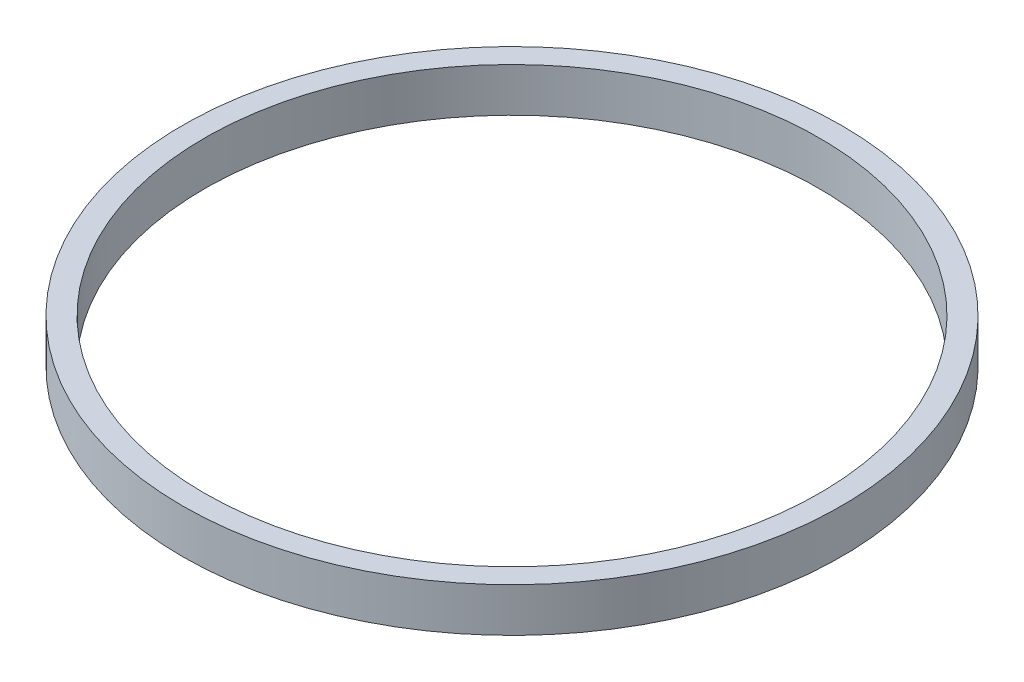
ISO-10303-21;
HEADER;
FILE_DESCRIPTION(('STEP AP214'),'2;1');
FILE_NAME('part.step','',(''),(''),'','','');
FILE_SCHEMA(('AUTOMOTIVE_DESIGN { 1 0 10303 214 1 1 1 1 }'));
ENDSEC;
DATA;
#1=APPLICATION_CONTEXT('core data for automotive mechanical design processes');
#2=APPLICATION_PROTOCOL_DEFINITION('international standard','automotive_design',2000,#1);
#3=PRODUCT_CONTEXT('',#1,'mechanical');
#4=PRODUCT('Part','Part','',(#3));
#5=PRODUCT_RELATED_PRODUCT_CATEGORY('part','',(#4));
#6=PRODUCT_DEFINITION_FORMATION('','',#4);
#7=PRODUCT_DEFINITION_CONTEXT('part definition',#1,'design');
#8=PRODUCT_DEFINITION('design','',#6,#7);
#9=PRODUCT_DEFINITION_SHAPE('','',#8);
#10=(LENGTH_UNIT() NAMED_UNIT(*) SI_UNIT(.MILLI.,.METRE.));
#11=(NAMED_UNIT(*) PLANE_ANGLE_UNIT() SI_UNIT($,.RADIAN.));
#12=(NAMED_UNIT(*) SI_UNIT($,.STERADIAN.) SOLID_ANGLE_UNIT());
#13=UNCERTAINTY_MEASURE_WITH_UNIT(LENGTH_MEASURE(1.E-05),#10,'distance_accuracy_value','');
#14=(GEOMETRIC_REPRESENTATION_CONTEXT(3) GLOBAL_UNCERTAINTY_ASSIGNED_CONTEXT((#13)) GLOBAL_UNIT_ASSIGNED_CONTEXT((#10,
#11,#12)) REPRESENTATION_CONTEXT('',''));
#15=CARTESIAN_POINT('',(0.,0.,0.));
#16=DIRECTION('',(0.,0.,1.));
#17=DIRECTION('',(1.,0.,0.));
#18=AXIS2_PLACEMENT_3D('',#15,#16,#17);
#19=CARTESIAN_POINT('',(0.,30.,0.));
#20=DIRECTION('',(0.,-1.,0.));
#21=DIRECTION('',(0.,0.,-1.));
#22=AXIS2_PLACEMENT_3D('',#19,#20,#21);
#23=CYLINDRICAL_SURFACE('',#22,225.);
#24=CARTESIAN_POINT('',(0.,30.,0.));
#25=DIRECTION('',(0.,1.,0.));
#26=DIRECTION('',(0.,0.,1.));
#27=AXIS2_PLACEMENT_3D('',#24,#25,#26);
#28=CIRCLE('',#27,225.);
#29=CARTESIAN_POINT('',(0.,30.,225.));
#30=VERTEX_POINT('',#29);
#31=EDGE_CURVE('E10',#30,#30,#28,.T.);
#32=ORIENTED_EDGE('',*,*,#31,.F.);
#33=EDGE_LOOP('',(#32));
#34=FACE_BOUND('',#33,.T.);
#35=CARTESIAN_POINT('',(0.,0.,0.));
#36=DIRECTION('',(0.,1.,0.));
#37=DIRECTION('',(0.,0.,1.));
#38=AXIS2_PLACEMENT_3D('',#35,#36,#37);
#39=CIRCLE('',#38,225.);
#40=CARTESIAN_POINT('',(0.,0.,225.));
#41=VERTEX_POINT('',#40);
#42=EDGE_CURVE('E34',#41,#41,#39,.T.);
#43=ORIENTED_EDGE('',*,*,#42,.T.);
#44=EDGE_LOOP('',(#43));
#45=FACE_BOUND('',#44,.T.);
#46=ADVANCED_FACE('F31',(#34,#45),#23,.T.);
#47=CARTESIAN_POINT('',(0.,30.,0.));
#48=DIRECTION('',(0.,1.,0.));
#49=DIRECTION('',(0.,0.,1.));
#50=AXIS2_PLACEMENT_3D('',#47,#48,#49);
#51=PLANE('',#50);
#52=CARTESIAN_POINT('',(0.,30.,0.));
#53=DIRECTION('',(0.,1.,0.));
#54=DIRECTION('',(0.,0.,1.));
#55=AXIS2_PLACEMENT_3D('',#52,#53,#54);
#56=CIRCLE('',#55,210.);
#57=CARTESIAN_POINT('',(0.,30.,210.));
#58=VERTEX_POINT('',#57);
#59=EDGE_CURVE('E41',#58,#58,#56,.T.);
#60=ORIENTED_EDGE('',*,*,#59,.F.);
#61=EDGE_LOOP('',(#60));
#62=FACE_BOUND('',#61,.T.);
#63=ORIENTED_EDGE('',*,*,#31,.T.);
#64=EDGE_LOOP('',(#63));
#65=FACE_BOUND('',#64,.T.);
#66=ADVANCED_FACE('F59',(#62,#65),#51,.T.);
#67=CARTESIAN_POINT('',(0.,0.,0.));
#68=DIRECTION('',(0.,1.,0.));
#69=DIRECTION('',(0.,0.,1.));
#70=AXIS2_PLACEMENT_3D('',#67,#68,#69);
#71=PLANE('',#70);
#72=CARTESIAN_POINT('',(0.,0.,0.));
#73=DIRECTION('',(0.,1.,0.));
#74=DIRECTION('',(0.,0.,1.));
#75=AXIS2_PLACEMENT_3D('',#72,#73,#74);
#76=CIRCLE('',#75,210.);
#77=CARTESIAN_POINT('',(0.,0.,210.));
#78=VERTEX_POINT('',#77);
#79=EDGE_CURVE('E45',#78,#78,#76,.T.);
#80=ORIENTED_EDGE('',*,*,#79,.T.);
#81=EDGE_LOOP('',(#80));
#82=FACE_BOUND('',#81,.T.);
#83=ORIENTED_EDGE('',*,*,#42,.F.);
#84=EDGE_LOOP('',(#83));
#85=FACE_BOUND('',#84,.T.);
#86=ADVANCED_FACE('F49',(#82,#85),#71,.F.);
#87=CARTESIAN_POINT('',(0.,0.,0.));
#88=DIRECTION('',(0.,1.,0.));
#89=DIRECTION('',(0.,0.,1.));
#90=AXIS2_PLACEMENT_3D('',#87,#88,#89);
#91=CYLINDRICAL_SURFACE('',#90,210.);
#92=ORIENTED_EDGE('',*,*,#59,.T.);
#93=EDGE_LOOP('',(#92));
#94=FACE_BOUND('',#93,.T.);
#95=ORIENTED_EDGE('',*,*,#79,.F.);
#96=EDGE_LOOP('',(#95));
#97=FACE_BOUND('',#96,.T.);
#98=ADVANCED_FACE('F52',(#94,#97),#91,.F.);
#99=CLOSED_SHELL('',(#46,#66,#86,#98));
#100=MANIFOLD_SOLID_BREP('B2',#99);
#101=ADVANCED_BREP_SHAPE_REPRESENTATION('',(#18,#100),#14);
#102=SHAPE_DEFINITION_REPRESENTATION(#9,#101);
ENDSEC;
END-ISO-10303-21;
